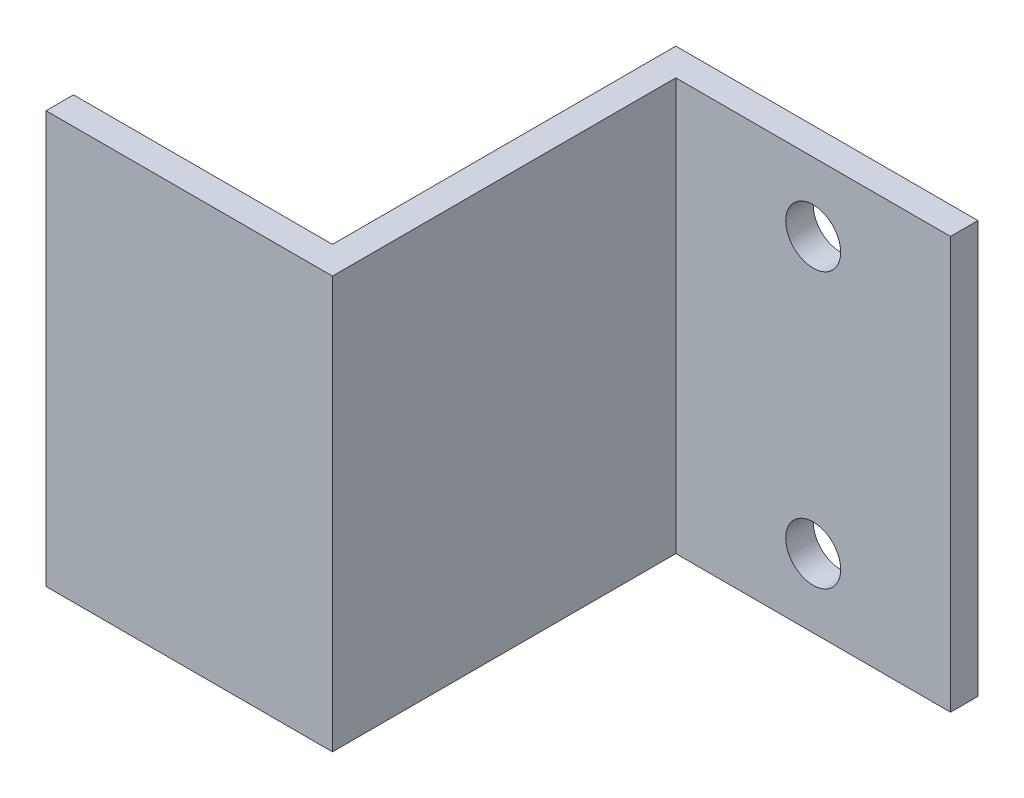
ISO-10303-21;
HEADER;
FILE_DESCRIPTION(('STEP AP214'),'2;1');
FILE_NAME('part.step','',(''),(''),'','','');
FILE_SCHEMA(('AUTOMOTIVE_DESIGN { 1 0 10303 214 1 1 1 1 }'));
ENDSEC;
DATA;
#1=APPLICATION_CONTEXT('core data for automotive mechanical design processes');
#2=APPLICATION_PROTOCOL_DEFINITION('international standard','automotive_design',2000,#1);
#3=PRODUCT_CONTEXT('',#1,'mechanical');
#4=PRODUCT('Part','Part','',(#3));
#5=PRODUCT_RELATED_PRODUCT_CATEGORY('part','',(#4));
#6=PRODUCT_DEFINITION_FORMATION('','',#4);
#7=PRODUCT_DEFINITION_CONTEXT('part definition',#1,'design');
#8=PRODUCT_DEFINITION('design','',#6,#7);
#9=PRODUCT_DEFINITION_SHAPE('','',#8);
#10=(LENGTH_UNIT() NAMED_UNIT(*) SI_UNIT(.MILLI.,.METRE.));
#11=(NAMED_UNIT(*) PLANE_ANGLE_UNIT() SI_UNIT($,.RADIAN.));
#12=(NAMED_UNIT(*) SI_UNIT($,.STERADIAN.) SOLID_ANGLE_UNIT());
#13=UNCERTAINTY_MEASURE_WITH_UNIT(LENGTH_MEASURE(1.E-05),#10,'distance_accuracy_value','');
#14=(GEOMETRIC_REPRESENTATION_CONTEXT(3) GLOBAL_UNCERTAINTY_ASSIGNED_CONTEXT((#13)) GLOBAL_UNIT_ASSIGNED_CONTEXT((#10,
#11,#12)) REPRESENTATION_CONTEXT('',''));
#15=CARTESIAN_POINT('',(0.,0.,0.));
#16=DIRECTION('',(0.,0.,1.));
#17=DIRECTION('',(1.,0.,0.));
#18=AXIS2_PLACEMENT_3D('',#15,#16,#17);
#19=CARTESIAN_POINT('',(0.,30.,-25.));
#20=DIRECTION('',(-1.,0.,0.));
#21=DIRECTION('',(0.,0.,1.));
#22=AXIS2_PLACEMENT_3D('',#19,#20,#21);
#23=PLANE('',#22);
#24=DIRECTION('',(0.,0.,-1.));
#25=VECTOR('',#24,1.);
#26=CARTESIAN_POINT('',(0.,0.,-25.));
#27=LINE('',#26,#25);
#28=CARTESIAN_POINT('',(0.,0.,0.));
#29=VERTEX_POINT('',#28);
#30=CARTESIAN_POINT('',(0.,0.,-25.));
#31=VERTEX_POINT('',#30);
#32=EDGE_CURVE('E131',#29,#31,#27,.T.);
#33=ORIENTED_EDGE('',*,*,#32,.T.);
#34=DIRECTION('',(0.,-1.,0.));
#35=VECTOR('',#34,1.);
#36=CARTESIAN_POINT('',(0.,30.,-25.));
#37=LINE('',#36,#35);
#38=CARTESIAN_POINT('',(0.,30.,-25.));
#39=VERTEX_POINT('',#38);
#40=EDGE_CURVE('E11',#39,#31,#37,.T.);
#41=ORIENTED_EDGE('',*,*,#40,.F.);
#42=DIRECTION('',(0.,0.,-1.));
#43=VECTOR('',#42,1.);
#44=CARTESIAN_POINT('',(0.,30.,-25.));
#45=LINE('',#44,#43);
#46=CARTESIAN_POINT('',(0.,30.,0.));
#47=VERTEX_POINT('',#46);
#48=EDGE_CURVE('E146',#47,#39,#45,.T.);
#49=ORIENTED_EDGE('',*,*,#48,.F.);
#50=DIRECTION('',(0.,-1.,0.));
#51=VECTOR('',#50,1.);
#52=CARTESIAN_POINT('',(0.,30.,0.));
#53=LINE('',#52,#51);
#54=EDGE_CURVE('E127',#47,#29,#53,.T.);
#55=ORIENTED_EDGE('',*,*,#54,.T.);
#56=EDGE_LOOP('',(#33,#41,#49,#55));
#57=FACE_BOUND('',#56,.T.);
#58=ADVANCED_FACE('F35',(#57),#23,.F.);
#59=CARTESIAN_POINT('',(20.,30.,-25.));
#60=DIRECTION('',(0.,0.,-1.));
#61=DIRECTION('',(-1.,0.,0.));
#62=AXIS2_PLACEMENT_3D('',#59,#60,#61);
#63=PLANE('',#62);
#64=CARTESIAN_POINT('',(9.99999999999999,25.,-25.));
#65=DIRECTION('',(0.,0.,-1.));
#66=DIRECTION('',(-1.,0.,0.));
#67=AXIS2_PLACEMENT_3D('',#64,#65,#66);
#68=CIRCLE('',#67,2.);
#69=CARTESIAN_POINT('',(7.99999999999999,25.,-25.));
#70=VERTEX_POINT('',#69);
#71=EDGE_CURVE('E135',#70,#70,#68,.T.);
#72=ORIENTED_EDGE('',*,*,#71,.T.);
#73=EDGE_LOOP('',(#72));
#74=FACE_BOUND('',#73,.T.);
#75=CARTESIAN_POINT('',(9.99999999999999,5.,-25.));
#76=DIRECTION('',(0.,0.,-1.));
#77=DIRECTION('',(-1.,0.,0.));
#78=AXIS2_PLACEMENT_3D('',#75,#76,#77);
#79=CIRCLE('',#78,2.);
#80=CARTESIAN_POINT('',(7.99999999999999,5.,-25.));
#81=VERTEX_POINT('',#80);
#82=EDGE_CURVE('E181',#81,#81,#79,.T.);
#83=ORIENTED_EDGE('',*,*,#82,.T.);
#84=EDGE_LOOP('',(#83));
#85=FACE_BOUND('',#84,.T.);
#86=DIRECTION('',(1.,0.,0.));
#87=VECTOR('',#86,1.);
#88=CARTESIAN_POINT('',(20.,0.,-25.));
#89=LINE('',#88,#87);
#90=CARTESIAN_POINT('',(20.,0.,-25.));
#91=VERTEX_POINT('',#90);
#92=EDGE_CURVE('E134',#31,#91,#89,.T.);
#93=ORIENTED_EDGE('',*,*,#92,.T.);
#94=DIRECTION('',(0.,-1.,0.));
#95=VECTOR('',#94,1.);
#96=CARTESIAN_POINT('',(20.,30.,-25.));
#97=LINE('',#96,#95);
#98=CARTESIAN_POINT('',(20.,30.,-25.));
#99=VERTEX_POINT('',#98);
#100=EDGE_CURVE('E43',#99,#91,#97,.T.);
#101=ORIENTED_EDGE('',*,*,#100,.F.);
#102=DIRECTION('',(1.,0.,0.));
#103=VECTOR('',#102,1.);
#104=CARTESIAN_POINT('',(20.,30.,-25.));
#105=LINE('',#104,#103);
#106=EDGE_CURVE('E94',#39,#99,#105,.T.);
#107=ORIENTED_EDGE('',*,*,#106,.F.);
#108=ORIENTED_EDGE('',*,*,#40,.T.);
#109=EDGE_LOOP('',(#93,#101,#107,#108));
#110=FACE_BOUND('',#109,.T.);
#111=ADVANCED_FACE('F205',(#74,#85,#110),#63,.F.);
#112=CARTESIAN_POINT('',(20.,30.,-27.));
#113=DIRECTION('',(-1.,0.,0.));
#114=DIRECTION('',(0.,0.,1.));
#115=AXIS2_PLACEMENT_3D('',#112,#113,#114);
#116=PLANE('',#115);
#117=DIRECTION('',(0.,0.,-1.));
#118=VECTOR('',#117,1.);
#119=CARTESIAN_POINT('',(20.,0.,-27.));
#120=LINE('',#119,#118);
#121=CARTESIAN_POINT('',(20.,0.,-27.));
#122=VERTEX_POINT('',#121);
#123=EDGE_CURVE('E137',#91,#122,#120,.T.);
#124=ORIENTED_EDGE('',*,*,#123,.T.);
#125=DIRECTION('',(0.,-1.,0.));
#126=VECTOR('',#125,1.);
#127=CARTESIAN_POINT('',(20.,30.,-27.));
#128=LINE('',#127,#126);
#129=CARTESIAN_POINT('',(20.,30.,-27.));
#130=VERTEX_POINT('',#129);
#131=EDGE_CURVE('E153',#130,#122,#128,.T.);
#132=ORIENTED_EDGE('',*,*,#131,.F.);
#133=DIRECTION('',(0.,0.,-1.));
#134=VECTOR('',#133,1.);
#135=CARTESIAN_POINT('',(20.,30.,-27.));
#136=LINE('',#135,#134);
#137=EDGE_CURVE('E161',#99,#130,#136,.T.);
#138=ORIENTED_EDGE('',*,*,#137,.F.);
#139=ORIENTED_EDGE('',*,*,#100,.T.);
#140=EDGE_LOOP('',(#124,#132,#138,#139));
#141=FACE_BOUND('',#140,.T.);
#142=ADVANCED_FACE('F159',(#141),#116,.F.);
#143=CARTESIAN_POINT('',(-2.,30.,-27.));
#144=DIRECTION('',(0.,0.,1.));
#145=DIRECTION('',(1.,0.,0.));
#146=AXIS2_PLACEMENT_3D('',#143,#144,#145);
#147=PLANE('',#146);
#148=CARTESIAN_POINT('',(9.99999999999999,25.,-27.));
#149=DIRECTION('',(0.,0.,-1.));
#150=DIRECTION('',(-1.,0.,0.));
#151=AXIS2_PLACEMENT_3D('',#148,#149,#150);
#152=CIRCLE('',#151,2.);
#153=CARTESIAN_POINT('',(7.99999999999999,25.,-27.));
#154=VERTEX_POINT('',#153);
#155=EDGE_CURVE('E184',#154,#154,#152,.T.);
#156=ORIENTED_EDGE('',*,*,#155,.F.);
#157=EDGE_LOOP('',(#156));
#158=FACE_BOUND('',#157,.T.);
#159=CARTESIAN_POINT('',(9.99999999999999,5.,-27.));
#160=DIRECTION('',(0.,0.,-1.));
#161=DIRECTION('',(-1.,0.,0.));
#162=AXIS2_PLACEMENT_3D('',#159,#160,#161);
#163=CIRCLE('',#162,2.);
#164=CARTESIAN_POINT('',(7.99999999999999,5.,-27.));
#165=VERTEX_POINT('',#164);
#166=EDGE_CURVE('E185',#165,#165,#163,.T.);
#167=ORIENTED_EDGE('',*,*,#166,.F.);
#168=EDGE_LOOP('',(#167));
#169=FACE_BOUND('',#168,.T.);
#170=DIRECTION('',(-1.,0.,0.));
#171=VECTOR('',#170,1.);
#172=CARTESIAN_POINT('',(-2.,0.,-27.));
#173=LINE('',#172,#171);
#174=CARTESIAN_POINT('',(-2.,0.,-27.));
#175=VERTEX_POINT('',#174);
#176=EDGE_CURVE('E139',#122,#175,#173,.T.);
#177=ORIENTED_EDGE('',*,*,#176,.T.);
#178=DIRECTION('',(0.,-1.,0.));
#179=VECTOR('',#178,1.);
#180=CARTESIAN_POINT('',(-2.,30.,-27.));
#181=LINE('',#180,#179);
#182=CARTESIAN_POINT('',(-2.,30.,-27.));
#183=VERTEX_POINT('',#182);
#184=EDGE_CURVE('E150',#183,#175,#181,.T.);
#185=ORIENTED_EDGE('',*,*,#184,.F.);
#186=DIRECTION('',(-1.,0.,0.));
#187=VECTOR('',#186,1.);
#188=CARTESIAN_POINT('',(-2.,30.,-27.));
#189=LINE('',#188,#187);
#190=EDGE_CURVE('E173',#130,#183,#189,.T.);
#191=ORIENTED_EDGE('',*,*,#190,.F.);
#192=ORIENTED_EDGE('',*,*,#131,.T.);
#193=EDGE_LOOP('',(#177,#185,#191,#192));
#194=FACE_BOUND('',#193,.T.);
#195=ADVANCED_FACE('F169',(#158,#169,#194),#147,.F.);
#196=CARTESIAN_POINT('',(-2.,30.,-2.));
#197=DIRECTION('',(1.,0.,0.));
#198=DIRECTION('',(0.,0.,-1.));
#199=AXIS2_PLACEMENT_3D('',#196,#197,#198);
#200=PLANE('',#199);
#201=DIRECTION('',(0.,0.,1.));
#202=VECTOR('',#201,1.);
#203=CARTESIAN_POINT('',(-2.,0.,-2.));
#204=LINE('',#203,#202);
#205=CARTESIAN_POINT('',(-2.,0.,-2.));
#206=VERTEX_POINT('',#205);
#207=EDGE_CURVE('E141',#175,#206,#204,.T.);
#208=ORIENTED_EDGE('',*,*,#207,.T.);
#209=DIRECTION('',(0.,-1.,0.));
#210=VECTOR('',#209,1.);
#211=CARTESIAN_POINT('',(-2.,30.,-2.));
#212=LINE('',#211,#210);
#213=CARTESIAN_POINT('',(-2.,30.,-2.));
#214=VERTEX_POINT('',#213);
#215=EDGE_CURVE('E122',#214,#206,#212,.T.);
#216=ORIENTED_EDGE('',*,*,#215,.F.);
#217=DIRECTION('',(0.,0.,1.));
#218=VECTOR('',#217,1.);
#219=CARTESIAN_POINT('',(-2.,30.,-2.));
#220=LINE('',#219,#218);
#221=EDGE_CURVE('E113',#183,#214,#220,.T.);
#222=ORIENTED_EDGE('',*,*,#221,.F.);
#223=ORIENTED_EDGE('',*,*,#184,.T.);
#224=EDGE_LOOP('',(#208,#216,#222,#223));
#225=FACE_BOUND('',#224,.T.);
#226=ADVANCED_FACE('F172',(#225),#200,.F.);
#227=CARTESIAN_POINT('',(-20.8563440916668,30.,-2.));
#228=DIRECTION('',(0.,0.,1.));
#229=DIRECTION('',(1.,0.,0.));
#230=AXIS2_PLACEMENT_3D('',#227,#228,#229);
#231=PLANE('',#230);
#232=DIRECTION('',(-1.,0.,0.));
#233=VECTOR('',#232,1.);
#234=CARTESIAN_POINT('',(-20.8563440916668,0.,-2.));
#235=LINE('',#234,#233);
#236=CARTESIAN_POINT('',(-20.8563440916668,0.,-2.));
#237=VERTEX_POINT('',#236);
#238=EDGE_CURVE('E121',#206,#237,#235,.T.);
#239=ORIENTED_EDGE('',*,*,#238,.T.);
#240=DIRECTION('',(0.,-1.,0.));
#241=VECTOR('',#240,1.);
#242=CARTESIAN_POINT('',(-20.8563440916668,30.,-2.));
#243=LINE('',#242,#241);
#244=CARTESIAN_POINT('',(-20.8563440916668,30.,-2.));
#245=VERTEX_POINT('',#244);
#246=EDGE_CURVE('E118',#245,#237,#243,.T.);
#247=ORIENTED_EDGE('',*,*,#246,.F.);
#248=DIRECTION('',(-1.,0.,0.));
#249=VECTOR('',#248,1.);
#250=CARTESIAN_POINT('',(-20.8563440916668,30.,-2.));
#251=LINE('',#250,#249);
#252=EDGE_CURVE('E107',#214,#245,#251,.T.);
#253=ORIENTED_EDGE('',*,*,#252,.F.);
#254=ORIENTED_EDGE('',*,*,#215,.T.);
#255=EDGE_LOOP('',(#239,#247,#253,#254));
#256=FACE_BOUND('',#255,.T.);
#257=ADVANCED_FACE('F119',(#256),#231,.F.);
#258=CARTESIAN_POINT('',(-20.8563440916668,30.,0.));
#259=DIRECTION('',(1.,0.,0.));
#260=DIRECTION('',(0.,0.,-1.));
#261=AXIS2_PLACEMENT_3D('',#258,#259,#260);
#262=PLANE('',#261);
#263=DIRECTION('',(0.,0.,1.));
#264=VECTOR('',#263,1.);
#265=CARTESIAN_POINT('',(-20.8563440916668,0.,0.));
#266=LINE('',#265,#264);
#267=CARTESIAN_POINT('',(-20.8563440916668,0.,0.));
#268=VERTEX_POINT('',#267);
#269=EDGE_CURVE('E80',#237,#268,#266,.T.);
#270=ORIENTED_EDGE('',*,*,#269,.T.);
#271=DIRECTION('',(0.,-1.,0.));
#272=VECTOR('',#271,1.);
#273=CARTESIAN_POINT('',(-20.8563440916668,30.,0.));
#274=LINE('',#273,#272);
#275=CARTESIAN_POINT('',(-20.8563440916668,30.,0.));
#276=VERTEX_POINT('',#275);
#277=EDGE_CURVE('E123',#276,#268,#274,.T.);
#278=ORIENTED_EDGE('',*,*,#277,.F.);
#279=DIRECTION('',(0.,0.,1.));
#280=VECTOR('',#279,1.);
#281=CARTESIAN_POINT('',(-20.8563440916668,30.,0.));
#282=LINE('',#281,#280);
#283=EDGE_CURVE('E111',#245,#276,#282,.T.);
#284=ORIENTED_EDGE('',*,*,#283,.F.);
#285=ORIENTED_EDGE('',*,*,#246,.T.);
#286=EDGE_LOOP('',(#270,#278,#284,#285));
#287=FACE_BOUND('',#286,.T.);
#288=ADVANCED_FACE('F125',(#287),#262,.F.);
#289=CARTESIAN_POINT('',(0.,30.,0.));
#290=DIRECTION('',(0.,0.,-1.));
#291=DIRECTION('',(-1.,0.,0.));
#292=AXIS2_PLACEMENT_3D('',#289,#290,#291);
#293=PLANE('',#292);
#294=DIRECTION('',(1.,0.,0.));
#295=VECTOR('',#294,1.);
#296=CARTESIAN_POINT('',(0.,0.,0.));
#297=LINE('',#296,#295);
#298=EDGE_CURVE('E86',#268,#29,#297,.T.);
#299=ORIENTED_EDGE('',*,*,#298,.T.);
#300=ORIENTED_EDGE('',*,*,#54,.F.);
#301=DIRECTION('',(1.,0.,0.));
#302=VECTOR('',#301,1.);
#303=CARTESIAN_POINT('',(0.,30.,0.));
#304=LINE('',#303,#302);
#305=EDGE_CURVE('E51',#276,#47,#304,.T.);
#306=ORIENTED_EDGE('',*,*,#305,.F.);
#307=ORIENTED_EDGE('',*,*,#277,.T.);
#308=EDGE_LOOP('',(#299,#300,#306,#307));
#309=FACE_BOUND('',#308,.T.);
#310=ADVANCED_FACE('F211',(#309),#293,.F.);
#311=CARTESIAN_POINT('',(0.,30.,0.));
#312=DIRECTION('',(0.,-1.,0.));
#313=DIRECTION('',(0.,0.,-1.));
#314=AXIS2_PLACEMENT_3D('',#311,#312,#313);
#315=PLANE('',#314);
#316=ORIENTED_EDGE('',*,*,#48,.T.);
#317=ORIENTED_EDGE('',*,*,#106,.T.);
#318=ORIENTED_EDGE('',*,*,#137,.T.);
#319=ORIENTED_EDGE('',*,*,#190,.T.);
#320=ORIENTED_EDGE('',*,*,#221,.T.);
#321=ORIENTED_EDGE('',*,*,#252,.T.);
#322=ORIENTED_EDGE('',*,*,#283,.T.);
#323=ORIENTED_EDGE('',*,*,#305,.T.);
#324=EDGE_LOOP('',(#316,#317,#318,#319,#320,#321,#322,#323));
#325=FACE_BOUND('',#324,.T.);
#326=ADVANCED_FACE('F109',(#325),#315,.F.);
#327=CARTESIAN_POINT('',(0.,0.,0.));
#328=DIRECTION('',(0.,-1.,0.));
#329=DIRECTION('',(0.,0.,-1.));
#330=AXIS2_PLACEMENT_3D('',#327,#328,#329);
#331=PLANE('',#330);
#332=ORIENTED_EDGE('',*,*,#32,.F.);
#333=ORIENTED_EDGE('',*,*,#298,.F.);
#334=ORIENTED_EDGE('',*,*,#269,.F.);
#335=ORIENTED_EDGE('',*,*,#238,.F.);
#336=ORIENTED_EDGE('',*,*,#207,.F.);
#337=ORIENTED_EDGE('',*,*,#176,.F.);
#338=ORIENTED_EDGE('',*,*,#123,.F.);
#339=ORIENTED_EDGE('',*,*,#92,.F.);
#340=EDGE_LOOP('',(#332,#333,#334,#335,#336,#337,#338,#339));
#341=FACE_BOUND('',#340,.T.);
#342=ADVANCED_FACE('F165',(#341),#331,.T.);
#343=CARTESIAN_POINT('',(9.99999999999999,5.,0.));
#344=DIRECTION('',(0.,0.,-1.));
#345=DIRECTION('',(-1.,0.,0.));
#346=AXIS2_PLACEMENT_3D('',#343,#344,#345);
#347=CYLINDRICAL_SURFACE('',#346,2.);
#348=ORIENTED_EDGE('',*,*,#166,.T.);
#349=EDGE_LOOP('',(#348));
#350=FACE_BOUND('',#349,.T.);
#351=ORIENTED_EDGE('',*,*,#82,.F.);
#352=EDGE_LOOP('',(#351));
#353=FACE_BOUND('',#352,.T.);
#354=ADVANCED_FACE('F199',(#350,#353),#347,.F.);
#355=CARTESIAN_POINT('',(9.99999999999999,25.,0.));
#356=DIRECTION('',(0.,0.,-1.));
#357=DIRECTION('',(-1.,0.,0.));
#358=AXIS2_PLACEMENT_3D('',#355,#356,#357);
#359=CYLINDRICAL_SURFACE('',#358,2.);
#360=ORIENTED_EDGE('',*,*,#155,.T.);
#361=EDGE_LOOP('',(#360));
#362=FACE_BOUND('',#361,.T.);
#363=ORIENTED_EDGE('',*,*,#71,.F.);
#364=EDGE_LOOP('',(#363));
#365=FACE_BOUND('',#364,.T.);
#366=ADVANCED_FACE('F191',(#362,#365),#359,.F.);
#367=CLOSED_SHELL('',(#58,#111,#142,#195,#226,#257,#288,#310,#326,#342,#354,#366));
#368=MANIFOLD_SOLID_BREP('B2',#367);
#369=ADVANCED_BREP_SHAPE_REPRESENTATION('',(#18,#368),#14);
#370=SHAPE_DEFINITION_REPRESENTATION(#9,#369);
ENDSEC;
END-ISO-10303-21;
